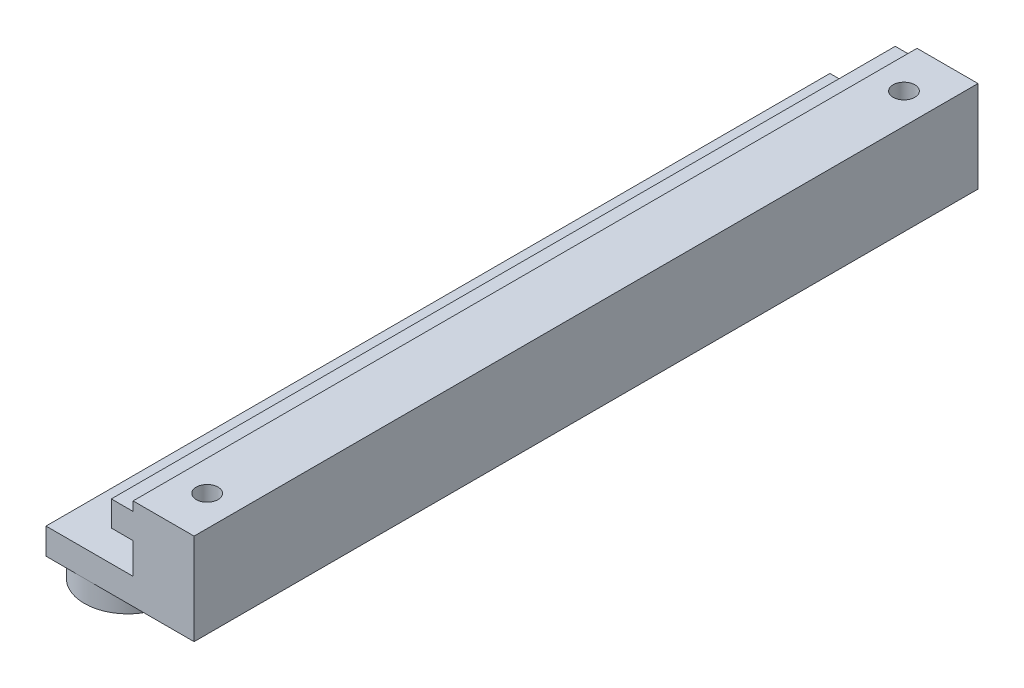
ISO-10303-21;
HEADER;
FILE_DESCRIPTION(('STEP AP214'),'2;1');
FILE_NAME('part.step','',(''),(''),'','','');
FILE_SCHEMA(('AUTOMOTIVE_DESIGN { 1 0 10303 214 1 1 1 1 }'));
ENDSEC;
DATA;
#1=APPLICATION_CONTEXT('core data for automotive mechanical design processes');
#2=APPLICATION_PROTOCOL_DEFINITION('international standard','automotive_design',2000,#1);
#3=PRODUCT_CONTEXT('',#1,'mechanical');
#4=PRODUCT('Part','Part','',(#3));
#5=PRODUCT_RELATED_PRODUCT_CATEGORY('part','',(#4));
#6=PRODUCT_DEFINITION_FORMATION('','',#4);
#7=PRODUCT_DEFINITION_CONTEXT('part definition',#1,'design');
#8=PRODUCT_DEFINITION('design','',#6,#7);
#9=PRODUCT_DEFINITION_SHAPE('','',#8);
#10=(LENGTH_UNIT() NAMED_UNIT(*) SI_UNIT(.MILLI.,.METRE.));
#11=(NAMED_UNIT(*) PLANE_ANGLE_UNIT() SI_UNIT($,.RADIAN.));
#12=(NAMED_UNIT(*) SI_UNIT($,.STERADIAN.) SOLID_ANGLE_UNIT());
#13=UNCERTAINTY_MEASURE_WITH_UNIT(LENGTH_MEASURE(1.E-05),#10,'distance_accuracy_value','');
#14=(GEOMETRIC_REPRESENTATION_CONTEXT(3) GLOBAL_UNCERTAINTY_ASSIGNED_CONTEXT((#13)) GLOBAL_UNIT_ASSIGNED_CONTEXT((#10,
#11,#12)) REPRESENTATION_CONTEXT('',''));
#15=CARTESIAN_POINT('',(0.,0.,0.));
#16=DIRECTION('',(0.,0.,1.));
#17=DIRECTION('',(1.,0.,0.));
#18=AXIS2_PLACEMENT_3D('',#15,#16,#17);
#19=CARTESIAN_POINT('',(7.,26.5,90.));
#20=DIRECTION('',(0.,1.,0.));
#21=DIRECTION('',(1.,0.,0.));
#22=AXIS2_PLACEMENT_3D('',#19,#20,#21);
#23=PLANE('',#22);
#24=CARTESIAN_POINT('',(-5.59999999999999,26.5,85.));
#25=DIRECTION('',(0.,1.,0.));
#26=DIRECTION('',(-1.,0.,0.));
#27=AXIS2_PLACEMENT_3D('',#24,#25,#26);
#28=CIRCLE('',#27,5.00000000000001);
#29=CARTESIAN_POINT('',(-10.,26.5,87.3748684174076));
#30=VERTEX_POINT('',#29);
#31=CARTESIAN_POINT('',(-5.59999999999999,26.5,90.));
#32=VERTEX_POINT('',#31);
#33=EDGE_CURVE('E45',#30,#32,#28,.T.);
#34=ORIENTED_EDGE('',*,*,#33,.T.);
#35=DIRECTION('',(-1.,0.,0.));
#36=VECTOR('',#35,1.);
#37=CARTESIAN_POINT('',(7.,26.5,90.));
#38=LINE('',#37,#36);
#39=CARTESIAN_POINT('',(-10.,26.5,90.));
#40=VERTEX_POINT('',#39);
#41=EDGE_CURVE('E152',#32,#40,#38,.T.);
#42=ORIENTED_EDGE('',*,*,#41,.T.);
#43=DIRECTION('',(0.,0.,-1.));
#44=VECTOR('',#43,1.);
#45=CARTESIAN_POINT('',(-10.,26.5,90.));
#46=LINE('',#45,#44);
#47=EDGE_CURVE('E151',#40,#30,#46,.T.);
#48=ORIENTED_EDGE('',*,*,#47,.T.);
#49=EDGE_LOOP('',(#34,#42,#48));
#50=FACE_BOUND('',#49,.T.);
#51=ADVANCED_FACE('F34',(#50),#23,.F.);
#52=CARTESIAN_POINT('',(-10.,26.5,90.));
#53=DIRECTION('',(1.,0.,0.));
#54=DIRECTION('',(0.,0.,-1.));
#55=AXIS2_PLACEMENT_3D('',#52,#53,#54);
#56=PLANE('',#55);
#57=DIRECTION('',(0.,1.,0.));
#58=VECTOR('',#57,1.);
#59=CARTESIAN_POINT('',(-10.,26.5,0.));
#60=LINE('',#59,#58);
#61=CARTESIAN_POINT('',(-10.,26.5,0.));
#62=VERTEX_POINT('',#61);
#63=CARTESIAN_POINT('',(-10.,29.5,0.));
#64=VERTEX_POINT('',#63);
#65=EDGE_CURVE('E149',#62,#64,#60,.T.);
#66=ORIENTED_EDGE('',*,*,#65,.F.);
#67=CARTESIAN_POINT('',(-10.,26.5,7.82513158259242));
#68=VERTEX_POINT('',#67);
#69=EDGE_CURVE('E137',#68,#62,#46,.T.);
#70=ORIENTED_EDGE('',*,*,#69,.F.);
#71=CARTESIAN_POINT('',(-10.,26.5,12.5748684174076));
#72=VERTEX_POINT('',#71);
#73=EDGE_CURVE('E143',#72,#68,#46,.T.);
#74=ORIENTED_EDGE('',*,*,#73,.F.);
#75=CARTESIAN_POINT('',(-10.,26.5,82.6251315825924));
#76=VERTEX_POINT('',#75);
#77=EDGE_CURVE('E140',#76,#72,#46,.T.);
#78=ORIENTED_EDGE('',*,*,#77,.F.);
#79=EDGE_CURVE('E158',#30,#76,#46,.T.);
#80=ORIENTED_EDGE('',*,*,#79,.F.);
#81=ORIENTED_EDGE('',*,*,#47,.F.);
#82=DIRECTION('',(0.,1.,0.));
#83=VECTOR('',#82,1.);
#84=CARTESIAN_POINT('',(-10.,26.5,90.));
#85=LINE('',#84,#83);
#86=CARTESIAN_POINT('',(-10.,29.5,90.));
#87=VERTEX_POINT('',#86);
#88=EDGE_CURVE('E170',#40,#87,#85,.T.);
#89=ORIENTED_EDGE('',*,*,#88,.T.);
#90=DIRECTION('',(0.,0.,-1.));
#91=VECTOR('',#90,1.);
#92=CARTESIAN_POINT('',(-10.,29.5,90.));
#93=LINE('',#92,#91);
#94=EDGE_CURVE('E43',#87,#64,#93,.T.);
#95=ORIENTED_EDGE('',*,*,#94,.T.);
#96=EDGE_LOOP('',(#66,#70,#74,#78,#80,#81,#89,#95));
#97=FACE_BOUND('',#96,.T.);
#98=ADVANCED_FACE('F36',(#97),#56,.F.);
#99=CARTESIAN_POINT('',(-10.,29.5,90.));
#100=DIRECTION('',(0.,-1.,0.));
#101=DIRECTION('',(-1.,0.,0.));
#102=AXIS2_PLACEMENT_3D('',#99,#100,#101);
#103=PLANE('',#102);
#104=CARTESIAN_POINT('',(-5.59999999999999,29.5,85.));
#105=DIRECTION('',(0.,1.,0.));
#106=DIRECTION('',(-1.,0.,0.));
#107=AXIS2_PLACEMENT_3D('',#104,#105,#106);
#108=CIRCLE('',#107,1.25);
#109=CARTESIAN_POINT('',(-6.84999999999999,29.5,85.));
#110=VERTEX_POINT('',#109);
#111=EDGE_CURVE('E264',#110,#110,#108,.T.);
#112=ORIENTED_EDGE('',*,*,#111,.F.);
#113=EDGE_LOOP('',(#112));
#114=FACE_BOUND('',#113,.T.);
#115=CARTESIAN_POINT('',(-5.59999999999999,29.5,10.2));
#116=DIRECTION('',(0.,1.,0.));
#117=DIRECTION('',(-1.,0.,0.));
#118=AXIS2_PLACEMENT_3D('',#115,#116,#117);
#119=CIRCLE('',#118,1.25);
#120=CARTESIAN_POINT('',(-6.84999999999999,29.5,10.2));
#121=VERTEX_POINT('',#120);
#122=EDGE_CURVE('E131',#121,#121,#119,.T.);
#123=ORIENTED_EDGE('',*,*,#122,.F.);
#124=EDGE_LOOP('',(#123));
#125=FACE_BOUND('',#124,.T.);
#126=DIRECTION('',(1.,0.,0.));
#127=VECTOR('',#126,1.);
#128=CARTESIAN_POINT('',(-10.,29.5,0.));
#129=LINE('',#128,#127);
#130=CARTESIAN_POINT('',(0.,29.5,0.));
#131=VERTEX_POINT('',#130);
#132=EDGE_CURVE('E180',#64,#131,#129,.T.);
#133=ORIENTED_EDGE('',*,*,#132,.F.);
#134=ORIENTED_EDGE('',*,*,#94,.F.);
#135=DIRECTION('',(1.,0.,0.));
#136=VECTOR('',#135,1.);
#137=CARTESIAN_POINT('',(-10.,29.5,90.));
#138=LINE('',#137,#136);
#139=CARTESIAN_POINT('',(0.,29.5,90.));
#140=VERTEX_POINT('',#139);
#141=EDGE_CURVE('E206',#87,#140,#138,.T.);
#142=ORIENTED_EDGE('',*,*,#141,.T.);
#143=DIRECTION('',(0.,0.,-1.));
#144=VECTOR('',#143,1.);
#145=CARTESIAN_POINT('',(0.,29.5,90.));
#146=LINE('',#145,#144);
#147=EDGE_CURVE('E254',#140,#131,#146,.T.);
#148=ORIENTED_EDGE('',*,*,#147,.T.);
#149=EDGE_LOOP('',(#133,#134,#142,#148));
#150=FACE_BOUND('',#149,.T.);
#151=ADVANCED_FACE('F306',(#114,#125,#150),#103,.F.);
#152=CARTESIAN_POINT('',(0.,29.5,90.));
#153=DIRECTION('',(1.,0.,0.));
#154=DIRECTION('',(0.,-1.,0.));
#155=AXIS2_PLACEMENT_3D('',#152,#153,#154);
#156=PLANE('',#155);
#157=DIRECTION('',(0.,1.,0.));
#158=VECTOR('',#157,1.);
#159=CARTESIAN_POINT('',(0.,29.5,0.));
#160=LINE('',#159,#158);
#161=CARTESIAN_POINT('',(0.,33.05,0.));
#162=VERTEX_POINT('',#161);
#163=EDGE_CURVE('E184',#131,#162,#160,.T.);
#164=ORIENTED_EDGE('',*,*,#163,.F.);
#165=ORIENTED_EDGE('',*,*,#147,.F.);
#166=DIRECTION('',(0.,1.,0.));
#167=VECTOR('',#166,1.);
#168=CARTESIAN_POINT('',(0.,29.5,90.));
#169=LINE('',#168,#167);
#170=CARTESIAN_POINT('',(0.,33.05,90.));
#171=VERTEX_POINT('',#170);
#172=EDGE_CURVE('E209',#140,#171,#169,.T.);
#173=ORIENTED_EDGE('',*,*,#172,.T.);
#174=DIRECTION('',(0.,0.,-1.));
#175=VECTOR('',#174,1.);
#176=CARTESIAN_POINT('',(0.,33.05,90.));
#177=LINE('',#176,#175);
#178=EDGE_CURVE('E251',#171,#162,#177,.T.);
#179=ORIENTED_EDGE('',*,*,#178,.T.);
#180=EDGE_LOOP('',(#164,#165,#173,#179));
#181=FACE_BOUND('',#180,.T.);
#182=ADVANCED_FACE('F403',(#181),#156,.F.);
#183=CARTESIAN_POINT('',(0.,33.05,90.));
#184=DIRECTION('',(0.,1.,0.));
#185=DIRECTION('',(0.,0.,-1.));
#186=AXIS2_PLACEMENT_3D('',#183,#184,#185);
#187=PLANE('',#186);
#188=DIRECTION('',(-1.,0.,0.));
#189=VECTOR('',#188,1.);
#190=CARTESIAN_POINT('',(0.,33.05,0.));
#191=LINE('',#190,#189);
#192=CARTESIAN_POINT('',(-2.5,33.05,0.));
#193=VERTEX_POINT('',#192);
#194=EDGE_CURVE('E187',#162,#193,#191,.T.);
#195=ORIENTED_EDGE('',*,*,#194,.F.);
#196=ORIENTED_EDGE('',*,*,#178,.F.);
#197=DIRECTION('',(-1.,0.,0.));
#198=VECTOR('',#197,1.);
#199=CARTESIAN_POINT('',(0.,33.05,90.));
#200=LINE('',#199,#198);
#201=CARTESIAN_POINT('',(-2.5,33.05,90.));
#202=VERTEX_POINT('',#201);
#203=EDGE_CURVE('E215',#171,#202,#200,.T.);
#204=ORIENTED_EDGE('',*,*,#203,.T.);
#205=DIRECTION('',(0.,0.,-1.));
#206=VECTOR('',#205,1.);
#207=CARTESIAN_POINT('',(-2.5,33.05,90.));
#208=LINE('',#207,#206);
#209=EDGE_CURVE('E248',#202,#193,#208,.T.);
#210=ORIENTED_EDGE('',*,*,#209,.T.);
#211=EDGE_LOOP('',(#195,#196,#204,#210));
#212=FACE_BOUND('',#211,.T.);
#213=ADVANCED_FACE('F394',(#212),#187,.F.);
#214=CARTESIAN_POINT('',(-2.5,33.05,90.));
#215=DIRECTION('',(1.,0.,0.));
#216=DIRECTION('',(0.,-1.,0.));
#217=AXIS2_PLACEMENT_3D('',#214,#215,#216);
#218=PLANE('',#217);
#219=DIRECTION('',(0.,1.,0.));
#220=VECTOR('',#219,1.);
#221=CARTESIAN_POINT('',(-2.5,33.05,0.));
#222=LINE('',#221,#220);
#223=CARTESIAN_POINT('',(-2.5,35.95,0.));
#224=VERTEX_POINT('',#223);
#225=EDGE_CURVE('E190',#193,#224,#222,.T.);
#226=ORIENTED_EDGE('',*,*,#225,.F.);
#227=ORIENTED_EDGE('',*,*,#209,.F.);
#228=DIRECTION('',(0.,1.,0.));
#229=VECTOR('',#228,1.);
#230=CARTESIAN_POINT('',(-2.5,33.05,90.));
#231=LINE('',#230,#229);
#232=CARTESIAN_POINT('',(-2.5,35.95,90.));
#233=VERTEX_POINT('',#232);
#234=EDGE_CURVE('E218',#202,#233,#231,.T.);
#235=ORIENTED_EDGE('',*,*,#234,.T.);
#236=DIRECTION('',(0.,0.,-1.));
#237=VECTOR('',#236,1.);
#238=CARTESIAN_POINT('',(-2.5,35.95,90.));
#239=LINE('',#238,#237);
#240=EDGE_CURVE('E245',#233,#224,#239,.T.);
#241=ORIENTED_EDGE('',*,*,#240,.T.);
#242=EDGE_LOOP('',(#226,#227,#235,#241));
#243=FACE_BOUND('',#242,.T.);
#244=ADVANCED_FACE('F385',(#243),#218,.F.);
#245=CARTESIAN_POINT('',(-2.5,35.95,90.));
#246=DIRECTION('',(0.,-1.,0.));
#247=DIRECTION('',(0.,0.,1.));
#248=AXIS2_PLACEMENT_3D('',#245,#246,#247);
#249=PLANE('',#248);
#250=DIRECTION('',(1.,0.,0.));
#251=VECTOR('',#250,1.);
#252=CARTESIAN_POINT('',(-2.5,35.95,0.));
#253=LINE('',#252,#251);
#254=CARTESIAN_POINT('',(0.,35.95,0.));
#255=VERTEX_POINT('',#254);
#256=EDGE_CURVE('E193',#224,#255,#253,.T.);
#257=ORIENTED_EDGE('',*,*,#256,.F.);
#258=ORIENTED_EDGE('',*,*,#240,.F.);
#259=DIRECTION('',(1.,0.,0.));
#260=VECTOR('',#259,1.);
#261=CARTESIAN_POINT('',(-2.5,35.95,90.));
#262=LINE('',#261,#260);
#263=CARTESIAN_POINT('',(0.,35.95,90.));
#264=VERTEX_POINT('',#263);
#265=EDGE_CURVE('E221',#233,#264,#262,.T.);
#266=ORIENTED_EDGE('',*,*,#265,.T.);
#267=DIRECTION('',(0.,0.,-1.));
#268=VECTOR('',#267,1.);
#269=CARTESIAN_POINT('',(0.,35.95,90.));
#270=LINE('',#269,#268);
#271=EDGE_CURVE('E240',#264,#255,#270,.T.);
#272=ORIENTED_EDGE('',*,*,#271,.T.);
#273=EDGE_LOOP('',(#257,#258,#266,#272));
#274=FACE_BOUND('',#273,.T.);
#275=ADVANCED_FACE('F376',(#274),#249,.F.);
#276=CARTESIAN_POINT('',(0.,35.95,90.));
#277=DIRECTION('',(1.,0.,0.));
#278=DIRECTION('',(0.,-1.,0.));
#279=AXIS2_PLACEMENT_3D('',#276,#277,#278);
#280=PLANE('',#279);
#281=DIRECTION('',(0.,1.,0.));
#282=VECTOR('',#281,1.);
#283=CARTESIAN_POINT('',(0.,35.95,0.));
#284=LINE('',#283,#282);
#285=CARTESIAN_POINT('',(0.,37.,0.));
#286=VERTEX_POINT('',#285);
#287=EDGE_CURVE('E196',#255,#286,#284,.T.);
#288=ORIENTED_EDGE('',*,*,#287,.F.);
#289=ORIENTED_EDGE('',*,*,#271,.F.);
#290=DIRECTION('',(0.,1.,0.));
#291=VECTOR('',#290,1.);
#292=CARTESIAN_POINT('',(0.,35.95,90.));
#293=LINE('',#292,#291);
#294=CARTESIAN_POINT('',(0.,37.,90.));
#295=VERTEX_POINT('',#294);
#296=EDGE_CURVE('E224',#264,#295,#293,.T.);
#297=ORIENTED_EDGE('',*,*,#296,.T.);
#298=DIRECTION('',(0.,0.,-1.));
#299=VECTOR('',#298,1.);
#300=CARTESIAN_POINT('',(0.,37.,90.));
#301=LINE('',#300,#299);
#302=EDGE_CURVE('E233',#295,#286,#301,.T.);
#303=ORIENTED_EDGE('',*,*,#302,.T.);
#304=EDGE_LOOP('',(#288,#289,#297,#303));
#305=FACE_BOUND('',#304,.T.);
#306=ADVANCED_FACE('F367',(#305),#280,.F.);
#307=CARTESIAN_POINT('',(0.,37.,90.));
#308=DIRECTION('',(0.,-1.,0.));
#309=DIRECTION('',(0.,0.,1.));
#310=AXIS2_PLACEMENT_3D('',#307,#308,#309);
#311=PLANE('',#310);
#312=CARTESIAN_POINT('',(3.5,37.,5.));
#313=DIRECTION('',(0.,1.,0.));
#314=DIRECTION('',(0.,0.,1.));
#315=AXIS2_PLACEMENT_3D('',#312,#313,#314);
#316=CIRCLE('',#315,1.25);
#317=CARTESIAN_POINT('',(3.5,37.,6.25));
#318=VERTEX_POINT('',#317);
#319=EDGE_CURVE('E271',#318,#318,#316,.T.);
#320=ORIENTED_EDGE('',*,*,#319,.F.);
#321=EDGE_LOOP('',(#320));
#322=FACE_BOUND('',#321,.T.);
#323=CARTESIAN_POINT('',(3.5,37.,85.));
#324=DIRECTION('',(0.,1.,0.));
#325=DIRECTION('',(0.,0.,1.));
#326=AXIS2_PLACEMENT_3D('',#323,#324,#325);
#327=CIRCLE('',#326,1.25);
#328=CARTESIAN_POINT('',(3.5,37.,86.25));
#329=VERTEX_POINT('',#328);
#330=EDGE_CURVE('E260',#329,#329,#327,.T.);
#331=ORIENTED_EDGE('',*,*,#330,.F.);
#332=EDGE_LOOP('',(#331));
#333=FACE_BOUND('',#332,.T.);
#334=DIRECTION('',(1.,0.,0.));
#335=VECTOR('',#334,1.);
#336=CARTESIAN_POINT('',(0.,37.,0.));
#337=LINE('',#336,#335);
#338=CARTESIAN_POINT('',(6.99999999999999,37.,0.));
#339=VERTEX_POINT('',#338);
#340=EDGE_CURVE('E199',#286,#339,#337,.T.);
#341=ORIENTED_EDGE('',*,*,#340,.F.);
#342=ORIENTED_EDGE('',*,*,#302,.F.);
#343=DIRECTION('',(1.,0.,0.));
#344=VECTOR('',#343,1.);
#345=CARTESIAN_POINT('',(0.,37.,90.));
#346=LINE('',#345,#344);
#347=CARTESIAN_POINT('',(6.99999999999999,37.,90.));
#348=VERTEX_POINT('',#347);
#349=EDGE_CURVE('E175',#295,#348,#346,.T.);
#350=ORIENTED_EDGE('',*,*,#349,.T.);
#351=DIRECTION('',(0.,0.,-1.));
#352=VECTOR('',#351,1.);
#353=CARTESIAN_POINT('',(6.99999999999999,37.,90.));
#354=LINE('',#353,#352);
#355=EDGE_CURVE('E164',#348,#339,#354,.T.);
#356=ORIENTED_EDGE('',*,*,#355,.T.);
#357=EDGE_LOOP('',(#341,#342,#350,#356));
#358=FACE_BOUND('',#357,.T.);
#359=ADVANCED_FACE('F230',(#322,#333,#358),#311,.F.);
#360=CARTESIAN_POINT('',(6.99999999999999,37.,90.));
#361=DIRECTION('',(-1.,0.,0.));
#362=DIRECTION('',(0.,1.,0.));
#363=AXIS2_PLACEMENT_3D('',#360,#361,#362);
#364=PLANE('',#363);
#365=DIRECTION('',(0.,-1.,0.));
#366=VECTOR('',#365,1.);
#367=CARTESIAN_POINT('',(6.99999999999999,37.,0.));
#368=LINE('',#367,#366);
#369=CARTESIAN_POINT('',(7.,26.5,0.));
#370=VERTEX_POINT('',#369);
#371=EDGE_CURVE('E202',#339,#370,#368,.T.);
#372=ORIENTED_EDGE('',*,*,#371,.F.);
#373=ORIENTED_EDGE('',*,*,#355,.F.);
#374=DIRECTION('',(0.,-1.,0.));
#375=VECTOR('',#374,1.);
#376=CARTESIAN_POINT('',(6.99999999999999,37.,90.));
#377=LINE('',#376,#375);
#378=CARTESIAN_POINT('',(7.,26.5,90.));
#379=VERTEX_POINT('',#378);
#380=EDGE_CURVE('E173',#348,#379,#377,.T.);
#381=ORIENTED_EDGE('',*,*,#380,.T.);
#382=DIRECTION('',(0.,0.,-1.));
#383=VECTOR('',#382,1.);
#384=CARTESIAN_POINT('',(7.,26.5,90.));
#385=LINE('',#384,#383);
#386=EDGE_CURVE('E157',#379,#370,#385,.T.);
#387=ORIENTED_EDGE('',*,*,#386,.T.);
#388=EDGE_LOOP('',(#372,#373,#381,#387));
#389=FACE_BOUND('',#388,.T.);
#390=ADVANCED_FACE('F238',(#389),#364,.F.);
#391=CARTESIAN_POINT('',(3.5,26.5,5.));
#392=DIRECTION('',(0.,-1.,0.));
#393=DIRECTION('',(1.,0.,0.));
#394=AXIS2_PLACEMENT_3D('',#391,#392,#393);
#395=CIRCLE('',#394,1.25);
#396=CARTESIAN_POINT('',(4.75,26.5,5.));
#397=VERTEX_POINT('',#396);
#398=EDGE_CURVE('E38',#397,#397,#395,.F.);
#399=ORIENTED_EDGE('',*,*,#398,.T.);
#400=EDGE_LOOP('',(#399));
#401=FACE_BOUND('',#400,.T.);
#402=CARTESIAN_POINT('',(3.5,26.5,85.));
#403=DIRECTION('',(0.,-1.,0.));
#404=DIRECTION('',(1.,0.,0.));
#405=AXIS2_PLACEMENT_3D('',#402,#403,#404);
#406=CIRCLE('',#405,1.25);
#407=CARTESIAN_POINT('',(4.75,26.5,85.));
#408=VERTEX_POINT('',#407);
#409=EDGE_CURVE('E257',#408,#408,#406,.F.);
#410=ORIENTED_EDGE('',*,*,#409,.T.);
#411=EDGE_LOOP('',(#410));
#412=FACE_BOUND('',#411,.T.);
#413=CARTESIAN_POINT('',(-5.59999999999999,26.5,10.2));
#414=DIRECTION('',(0.,1.,0.));
#415=DIRECTION('',(-1.,0.,0.));
#416=AXIS2_PLACEMENT_3D('',#413,#414,#415);
#417=CIRCLE('',#416,5.);
#418=EDGE_CURVE('E129',#72,#68,#417,.T.);
#419=ORIENTED_EDGE('',*,*,#418,.T.);
#420=ORIENTED_EDGE('',*,*,#69,.T.);
#421=DIRECTION('',(-1.,0.,0.));
#422=VECTOR('',#421,1.);
#423=CARTESIAN_POINT('',(7.,26.5,0.));
#424=LINE('',#423,#422);
#425=EDGE_CURVE('E204',#370,#62,#424,.T.);
#426=ORIENTED_EDGE('',*,*,#425,.F.);
#427=ORIENTED_EDGE('',*,*,#386,.F.);
#428=EDGE_CURVE('E150',#379,#32,#38,.T.);
#429=ORIENTED_EDGE('',*,*,#428,.T.);
#430=EDGE_CURVE('E11',#32,#76,#28,.T.);
#431=ORIENTED_EDGE('',*,*,#430,.T.);
#432=ORIENTED_EDGE('',*,*,#77,.T.);
#433=EDGE_LOOP('',(#419,#420,#426,#427,#429,#431,#432));
#434=FACE_BOUND('',#433,.T.);
#435=ADVANCED_FACE('F135',(#401,#412,#434),#23,.F.);
#436=CARTESIAN_POINT('',(0.,37.,90.));
#437=DIRECTION('',(0.,0.,1.));
#438=DIRECTION('',(1.,0.,0.));
#439=AXIS2_PLACEMENT_3D('',#436,#437,#438);
#440=PLANE('',#439);
#441=ORIENTED_EDGE('',*,*,#88,.F.);
#442=ORIENTED_EDGE('',*,*,#41,.F.);
#443=ORIENTED_EDGE('',*,*,#428,.F.);
#444=ORIENTED_EDGE('',*,*,#380,.F.);
#445=ORIENTED_EDGE('',*,*,#349,.F.);
#446=ORIENTED_EDGE('',*,*,#296,.F.);
#447=ORIENTED_EDGE('',*,*,#265,.F.);
#448=ORIENTED_EDGE('',*,*,#234,.F.);
#449=ORIENTED_EDGE('',*,*,#203,.F.);
#450=ORIENTED_EDGE('',*,*,#172,.F.);
#451=ORIENTED_EDGE('',*,*,#141,.F.);
#452=EDGE_LOOP('',(#441,#442,#443,#444,#445,#446,#447,#448,#449,#450,#451));
#453=FACE_BOUND('',#452,.T.);
#454=ADVANCED_FACE('F234',(#453),#440,.T.);
#455=CARTESIAN_POINT('',(0.,37.,0.));
#456=DIRECTION('',(0.,0.,1.));
#457=DIRECTION('',(1.,0.,0.));
#458=AXIS2_PLACEMENT_3D('',#455,#456,#457);
#459=PLANE('',#458);
#460=ORIENTED_EDGE('',*,*,#65,.T.);
#461=ORIENTED_EDGE('',*,*,#132,.T.);
#462=ORIENTED_EDGE('',*,*,#163,.T.);
#463=ORIENTED_EDGE('',*,*,#194,.T.);
#464=ORIENTED_EDGE('',*,*,#225,.T.);
#465=ORIENTED_EDGE('',*,*,#256,.T.);
#466=ORIENTED_EDGE('',*,*,#287,.T.);
#467=ORIENTED_EDGE('',*,*,#340,.T.);
#468=ORIENTED_EDGE('',*,*,#371,.T.);
#469=ORIENTED_EDGE('',*,*,#425,.T.);
#470=EDGE_LOOP('',(#460,#461,#462,#463,#464,#465,#466,#467,#468,#469));
#471=FACE_BOUND('',#470,.T.);
#472=ADVANCED_FACE('F297',(#471),#459,.F.);
#473=CARTESIAN_POINT('',(-5.59999999999999,24.,85.));
#474=DIRECTION('',(0.,1.,0.));
#475=DIRECTION('',(1.,0.,0.));
#476=AXIS2_PLACEMENT_3D('',#473,#474,#475);
#477=CYLINDRICAL_SURFACE('',#476,5.00000000000001);
#478=CARTESIAN_POINT('',(-5.59999999999999,24.,85.));
#479=DIRECTION('',(0.,1.,0.));
#480=DIRECTION('',(-1.,0.,0.));
#481=AXIS2_PLACEMENT_3D('',#478,#479,#480);
#482=CIRCLE('',#481,5.00000000000001);
#483=CARTESIAN_POINT('',(-10.6,24.,85.));
#484=VERTEX_POINT('',#483);
#485=EDGE_CURVE('E181',#484,#484,#482,.T.);
#486=ORIENTED_EDGE('',*,*,#485,.T.);
#487=EDGE_LOOP('',(#486));
#488=FACE_BOUND('',#487,.T.);
#489=ORIENTED_EDGE('',*,*,#33,.F.);
#490=EDGE_CURVE('E46',#76,#30,#28,.T.);
#491=ORIENTED_EDGE('',*,*,#490,.F.);
#492=ORIENTED_EDGE('',*,*,#430,.F.);
#493=EDGE_LOOP('',(#489,#491,#492));
#494=FACE_BOUND('',#493,.T.);
#495=ADVANCED_FACE('F285',(#488,#494),#477,.T.);
#496=CARTESIAN_POINT('',(-5.59999999999999,24.,85.));
#497=DIRECTION('',(0.,-1.,0.));
#498=DIRECTION('',(-1.,0.,0.));
#499=AXIS2_PLACEMENT_3D('',#496,#497,#498);
#500=PLANE('',#499);
#501=CARTESIAN_POINT('',(-5.59999999999999,24.,85.));
#502=DIRECTION('',(0.,1.,0.));
#503=DIRECTION('',(-1.,0.,0.));
#504=AXIS2_PLACEMENT_3D('',#501,#502,#503);
#505=CIRCLE('',#504,1.25);
#506=CARTESIAN_POINT('',(-6.84999999999999,24.,85.));
#507=VERTEX_POINT('',#506);
#508=EDGE_CURVE('E259',#507,#507,#505,.T.);
#509=ORIENTED_EDGE('',*,*,#508,.T.);
#510=EDGE_LOOP('',(#509));
#511=FACE_BOUND('',#510,.T.);
#512=ORIENTED_EDGE('',*,*,#485,.F.);
#513=EDGE_LOOP('',(#512));
#514=FACE_BOUND('',#513,.T.);
#515=ADVANCED_FACE('F287',(#511,#514),#500,.T.);
#516=CARTESIAN_POINT('',(-5.59999999999999,26.5,85.));
#517=DIRECTION('',(0.,-1.,0.));
#518=DIRECTION('',(-1.,0.,0.));
#519=AXIS2_PLACEMENT_3D('',#516,#517,#518);
#520=PLANE('',#519);
#521=ORIENTED_EDGE('',*,*,#79,.T.);
#522=ORIENTED_EDGE('',*,*,#490,.T.);
#523=EDGE_LOOP('',(#521,#522));
#524=FACE_BOUND('',#523,.T.);
#525=ADVANCED_FACE('F168',(#524),#520,.F.);
#526=CARTESIAN_POINT('',(-5.59999999999999,26.5,10.2));
#527=DIRECTION('',(0.,-1.,0.));
#528=DIRECTION('',(-1.,0.,0.));
#529=AXIS2_PLACEMENT_3D('',#526,#527,#528);
#530=PLANE('',#529);
#531=EDGE_CURVE('E52',#68,#72,#417,.T.);
#532=ORIENTED_EDGE('',*,*,#531,.T.);
#533=ORIENTED_EDGE('',*,*,#73,.T.);
#534=EDGE_LOOP('',(#532,#533));
#535=FACE_BOUND('',#534,.T.);
#536=ADVANCED_FACE('F144',(#535),#530,.F.);
#537=CARTESIAN_POINT('',(-5.59999999999999,24.,10.2));
#538=DIRECTION('',(0.,1.,0.));
#539=DIRECTION('',(1.,0.,0.));
#540=AXIS2_PLACEMENT_3D('',#537,#538,#539);
#541=CYLINDRICAL_SURFACE('',#540,5.);
#542=CARTESIAN_POINT('',(-5.59999999999999,24.,10.2));
#543=DIRECTION('',(0.,1.,0.));
#544=DIRECTION('',(-1.,0.,0.));
#545=AXIS2_PLACEMENT_3D('',#542,#543,#544);
#546=CIRCLE('',#545,5.);
#547=CARTESIAN_POINT('',(-10.6,24.,10.2));
#548=VERTEX_POINT('',#547);
#549=EDGE_CURVE('E142',#548,#548,#546,.T.);
#550=ORIENTED_EDGE('',*,*,#549,.T.);
#551=EDGE_LOOP('',(#550));
#552=FACE_BOUND('',#551,.T.);
#553=ORIENTED_EDGE('',*,*,#418,.F.);
#554=ORIENTED_EDGE('',*,*,#531,.F.);
#555=EDGE_LOOP('',(#553,#554));
#556=FACE_BOUND('',#555,.T.);
#557=ADVANCED_FACE('F128',(#552,#556),#541,.T.);
#558=CARTESIAN_POINT('',(-5.59999999999999,24.,10.2));
#559=DIRECTION('',(0.,-1.,0.));
#560=DIRECTION('',(-1.,0.,0.));
#561=AXIS2_PLACEMENT_3D('',#558,#559,#560);
#562=PLANE('',#561);
#563=CARTESIAN_POINT('',(-5.59999999999999,24.,10.2));
#564=DIRECTION('',(0.,1.,0.));
#565=DIRECTION('',(-1.,0.,0.));
#566=AXIS2_PLACEMENT_3D('',#563,#564,#565);
#567=CIRCLE('',#566,1.25);
#568=CARTESIAN_POINT('',(-6.84999999999999,24.,10.2));
#569=VERTEX_POINT('',#568);
#570=EDGE_CURVE('E276',#569,#569,#567,.T.);
#571=ORIENTED_EDGE('',*,*,#570,.T.);
#572=EDGE_LOOP('',(#571));
#573=FACE_BOUND('',#572,.T.);
#574=ORIENTED_EDGE('',*,*,#549,.F.);
#575=EDGE_LOOP('',(#574));
#576=FACE_BOUND('',#575,.T.);
#577=ADVANCED_FACE('F338',(#573,#576),#562,.T.);
#578=CARTESIAN_POINT('',(-5.59999999999999,37.,10.2));
#579=DIRECTION('',(0.,-1.,0.));
#580=DIRECTION('',(-1.,0.,0.));
#581=AXIS2_PLACEMENT_3D('',#578,#579,#580);
#582=CYLINDRICAL_SURFACE('',#581,1.25);
#583=ORIENTED_EDGE('',*,*,#570,.F.);
#584=EDGE_LOOP('',(#583));
#585=FACE_BOUND('',#584,.T.);
#586=ORIENTED_EDGE('',*,*,#122,.T.);
#587=EDGE_LOOP('',(#586));
#588=FACE_BOUND('',#587,.T.);
#589=ADVANCED_FACE('F334',(#585,#588),#582,.F.);
#590=CARTESIAN_POINT('',(-5.59999999999999,37.,85.));
#591=DIRECTION('',(0.,-1.,0.));
#592=DIRECTION('',(-1.,0.,0.));
#593=AXIS2_PLACEMENT_3D('',#590,#591,#592);
#594=CYLINDRICAL_SURFACE('',#593,1.25);
#595=ORIENTED_EDGE('',*,*,#508,.F.);
#596=EDGE_LOOP('',(#595));
#597=FACE_BOUND('',#596,.T.);
#598=ORIENTED_EDGE('',*,*,#111,.T.);
#599=EDGE_LOOP('',(#598));
#600=FACE_BOUND('',#599,.T.);
#601=ADVANCED_FACE('F328',(#597,#600),#594,.F.);
#602=CARTESIAN_POINT('',(3.5,24.,85.));
#603=DIRECTION('',(0.,1.,0.));
#604=DIRECTION('',(0.,0.,-1.));
#605=AXIS2_PLACEMENT_3D('',#602,#603,#604);
#606=CYLINDRICAL_SURFACE('',#605,1.25);
#607=ORIENTED_EDGE('',*,*,#330,.T.);
#608=EDGE_LOOP('',(#607));
#609=FACE_BOUND('',#608,.T.);
#610=ORIENTED_EDGE('',*,*,#409,.F.);
#611=EDGE_LOOP('',(#610));
#612=FACE_BOUND('',#611,.T.);
#613=ADVANCED_FACE('F321',(#609,#612),#606,.F.);
#614=CARTESIAN_POINT('',(3.5,24.,5.));
#615=DIRECTION('',(0.,1.,0.));
#616=DIRECTION('',(0.,0.,-1.));
#617=AXIS2_PLACEMENT_3D('',#614,#615,#616);
#618=CYLINDRICAL_SURFACE('',#617,1.25);
#619=ORIENTED_EDGE('',*,*,#319,.T.);
#620=EDGE_LOOP('',(#619));
#621=FACE_BOUND('',#620,.T.);
#622=ORIENTED_EDGE('',*,*,#398,.F.);
#623=EDGE_LOOP('',(#622));
#624=FACE_BOUND('',#623,.T.);
#625=ADVANCED_FACE('F319',(#621,#624),#618,.F.);
#626=CLOSED_SHELL('',(#51,#98,#151,#182,#213,#244,#275,#306,#359,#390,#435,#454,#472,#495,#515,
#525,#536,#557,#577,#589,#601,#613,#625));
#627=MANIFOLD_SOLID_BREP('B2',#626);
#628=ADVANCED_BREP_SHAPE_REPRESENTATION('',(#18,#627),#14);
#629=SHAPE_DEFINITION_REPRESENTATION(#9,#628);
ENDSEC;
END-ISO-10303-21;
